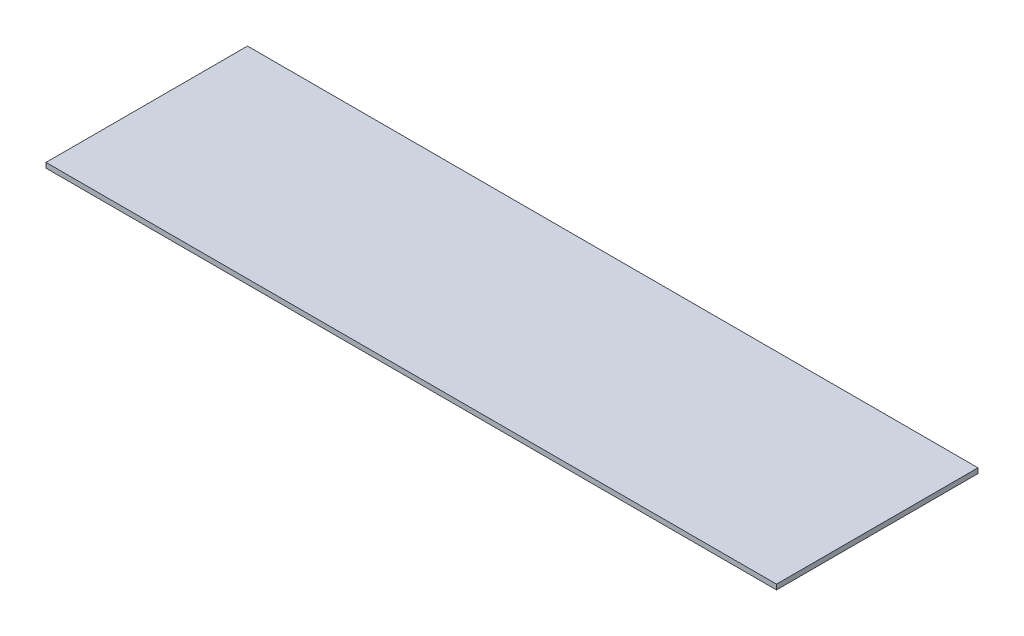
ISO-10303-21;
HEADER;
FILE_DESCRIPTION(('STEP AP214'),'2;1');
FILE_NAME('part.step','',(''),(''),'','','');
FILE_SCHEMA(('AUTOMOTIVE_DESIGN { 1 0 10303 214 1 1 1 1 }'));
ENDSEC;
DATA;
#1=APPLICATION_CONTEXT('core data for automotive mechanical design processes');
#2=APPLICATION_PROTOCOL_DEFINITION('international standard','automotive_design',2000,#1);
#3=PRODUCT_CONTEXT('',#1,'mechanical');
#4=PRODUCT('Part','Part','',(#3));
#5=PRODUCT_RELATED_PRODUCT_CATEGORY('part','',(#4));
#6=PRODUCT_DEFINITION_FORMATION('','',#4);
#7=PRODUCT_DEFINITION_CONTEXT('part definition',#1,'design');
#8=PRODUCT_DEFINITION('design','',#6,#7);
#9=PRODUCT_DEFINITION_SHAPE('','',#8);
#10=(LENGTH_UNIT() NAMED_UNIT(*) SI_UNIT(.MILLI.,.METRE.));
#11=(NAMED_UNIT(*) PLANE_ANGLE_UNIT() SI_UNIT($,.RADIAN.));
#12=(NAMED_UNIT(*) SI_UNIT($,.STERADIAN.) SOLID_ANGLE_UNIT());
#13=UNCERTAINTY_MEASURE_WITH_UNIT(LENGTH_MEASURE(1.E-05),#10,'distance_accuracy_value','');
#14=(GEOMETRIC_REPRESENTATION_CONTEXT(3) GLOBAL_UNCERTAINTY_ASSIGNED_CONTEXT((#13)) GLOBAL_UNIT_ASSIGNED_CONTEXT((#10,
#11,#12)) REPRESENTATION_CONTEXT('',''));
#15=CARTESIAN_POINT('',(0.,0.,0.));
#16=DIRECTION('',(0.,0.,1.));
#17=DIRECTION('',(1.,0.,0.));
#18=AXIS2_PLACEMENT_3D('',#15,#16,#17);
#19=CARTESIAN_POINT('',(145.,2.,40.));
#20=DIRECTION('',(-1.,0.,0.));
#21=DIRECTION('',(0.,0.,1.));
#22=AXIS2_PLACEMENT_3D('',#19,#20,#21);
#23=PLANE('',#22);
#24=DIRECTION('',(0.,0.,-1.));
#25=VECTOR('',#24,1.);
#26=CARTESIAN_POINT('',(145.,0.,40.));
#27=LINE('',#26,#25);
#28=CARTESIAN_POINT('',(145.,0.,40.));
#29=VERTEX_POINT('',#28);
#30=CARTESIAN_POINT('',(145.,0.,-40.));
#31=VERTEX_POINT('',#30);
#32=EDGE_CURVE('E96',#29,#31,#27,.T.);
#33=ORIENTED_EDGE('',*,*,#32,.T.);
#34=DIRECTION('',(0.,-1.,0.));
#35=VECTOR('',#34,1.);
#36=CARTESIAN_POINT('',(145.,2.,-40.));
#37=LINE('',#36,#35);
#38=CARTESIAN_POINT('',(145.,2.,-40.));
#39=VERTEX_POINT('',#38);
#40=EDGE_CURVE('E11',#39,#31,#37,.T.);
#41=ORIENTED_EDGE('',*,*,#40,.F.);
#42=DIRECTION('',(0.,0.,-1.));
#43=VECTOR('',#42,1.);
#44=CARTESIAN_POINT('',(145.,2.,40.));
#45=LINE('',#44,#43);
#46=CARTESIAN_POINT('',(145.,2.,40.));
#47=VERTEX_POINT('',#46);
#48=EDGE_CURVE('E84',#47,#39,#45,.T.);
#49=ORIENTED_EDGE('',*,*,#48,.F.);
#50=DIRECTION('',(0.,-1.,0.));
#51=VECTOR('',#50,1.);
#52=CARTESIAN_POINT('',(145.,2.,40.));
#53=LINE('',#52,#51);
#54=EDGE_CURVE('E92',#47,#29,#53,.T.);
#55=ORIENTED_EDGE('',*,*,#54,.T.);
#56=EDGE_LOOP('',(#33,#41,#49,#55));
#57=FACE_BOUND('',#56,.T.);
#58=ADVANCED_FACE('F33',(#57),#23,.F.);
#59=CARTESIAN_POINT('',(-145.,2.,-40.));
#60=DIRECTION('',(0.,0.,1.));
#61=DIRECTION('',(1.,0.,0.));
#62=AXIS2_PLACEMENT_3D('',#59,#60,#61);
#63=PLANE('',#62);
#64=DIRECTION('',(-1.,0.,0.));
#65=VECTOR('',#64,1.);
#66=CARTESIAN_POINT('',(-145.,0.,-40.));
#67=LINE('',#66,#65);
#68=CARTESIAN_POINT('',(-145.,0.,-40.));
#69=VERTEX_POINT('',#68);
#70=EDGE_CURVE('E88',#31,#69,#67,.T.);
#71=ORIENTED_EDGE('',*,*,#70,.T.);
#72=DIRECTION('',(0.,-1.,0.));
#73=VECTOR('',#72,1.);
#74=CARTESIAN_POINT('',(-145.,2.,-40.));
#75=LINE('',#74,#73);
#76=CARTESIAN_POINT('',(-145.,2.,-40.));
#77=VERTEX_POINT('',#76);
#78=EDGE_CURVE('E41',#77,#69,#75,.T.);
#79=ORIENTED_EDGE('',*,*,#78,.F.);
#80=DIRECTION('',(-1.,0.,0.));
#81=VECTOR('',#80,1.);
#82=CARTESIAN_POINT('',(-145.,2.,-40.));
#83=LINE('',#82,#81);
#84=EDGE_CURVE('E79',#39,#77,#83,.T.);
#85=ORIENTED_EDGE('',*,*,#84,.F.);
#86=ORIENTED_EDGE('',*,*,#40,.T.);
#87=EDGE_LOOP('',(#71,#79,#85,#86));
#88=FACE_BOUND('',#87,.T.);
#89=ADVANCED_FACE('F87',(#88),#63,.F.);
#90=CARTESIAN_POINT('',(-145.,2.,40.));
#91=DIRECTION('',(1.,0.,0.));
#92=DIRECTION('',(0.,0.,-1.));
#93=AXIS2_PLACEMENT_3D('',#90,#91,#92);
#94=PLANE('',#93);
#95=DIRECTION('',(0.,0.,1.));
#96=VECTOR('',#95,1.);
#97=CARTESIAN_POINT('',(-145.,0.,40.));
#98=LINE('',#97,#96);
#99=CARTESIAN_POINT('',(-145.,0.,40.));
#100=VERTEX_POINT('',#99);
#101=EDGE_CURVE('E66',#69,#100,#98,.T.);
#102=ORIENTED_EDGE('',*,*,#101,.T.);
#103=DIRECTION('',(0.,-1.,0.));
#104=VECTOR('',#103,1.);
#105=CARTESIAN_POINT('',(-145.,2.,40.));
#106=LINE('',#105,#104);
#107=CARTESIAN_POINT('',(-145.,2.,40.));
#108=VERTEX_POINT('',#107);
#109=EDGE_CURVE('E89',#108,#100,#106,.T.);
#110=ORIENTED_EDGE('',*,*,#109,.F.);
#111=DIRECTION('',(0.,0.,1.));
#112=VECTOR('',#111,1.);
#113=CARTESIAN_POINT('',(-145.,2.,40.));
#114=LINE('',#113,#112);
#115=EDGE_CURVE('E82',#77,#108,#114,.T.);
#116=ORIENTED_EDGE('',*,*,#115,.F.);
#117=ORIENTED_EDGE('',*,*,#78,.T.);
#118=EDGE_LOOP('',(#102,#110,#116,#117));
#119=FACE_BOUND('',#118,.T.);
#120=ADVANCED_FACE('F90',(#119),#94,.F.);
#121=CARTESIAN_POINT('',(-145.,2.,40.));
#122=DIRECTION('',(0.,0.,-1.));
#123=DIRECTION('',(-1.,0.,0.));
#124=AXIS2_PLACEMENT_3D('',#121,#122,#123);
#125=PLANE('',#124);
#126=DIRECTION('',(1.,0.,0.));
#127=VECTOR('',#126,1.);
#128=CARTESIAN_POINT('',(-145.,0.,40.));
#129=LINE('',#128,#127);
#130=EDGE_CURVE('E72',#100,#29,#129,.T.);
#131=ORIENTED_EDGE('',*,*,#130,.T.);
#132=ORIENTED_EDGE('',*,*,#54,.F.);
#133=DIRECTION('',(1.,0.,0.));
#134=VECTOR('',#133,1.);
#135=CARTESIAN_POINT('',(-145.,2.,40.));
#136=LINE('',#135,#134);
#137=EDGE_CURVE('E49',#108,#47,#136,.T.);
#138=ORIENTED_EDGE('',*,*,#137,.F.);
#139=ORIENTED_EDGE('',*,*,#109,.T.);
#140=EDGE_LOOP('',(#131,#132,#138,#139));
#141=FACE_BOUND('',#140,.T.);
#142=ADVANCED_FACE('F103',(#141),#125,.F.);
#143=CARTESIAN_POINT('',(0.,2.,0.));
#144=DIRECTION('',(0.,-1.,0.));
#145=DIRECTION('',(0.,0.,-1.));
#146=AXIS2_PLACEMENT_3D('',#143,#144,#145);
#147=PLANE('',#146);
#148=ORIENTED_EDGE('',*,*,#48,.T.);
#149=ORIENTED_EDGE('',*,*,#84,.T.);
#150=ORIENTED_EDGE('',*,*,#115,.T.);
#151=ORIENTED_EDGE('',*,*,#137,.T.);
#152=EDGE_LOOP('',(#148,#149,#150,#151));
#153=FACE_BOUND('',#152,.T.);
#154=ADVANCED_FACE('F80',(#153),#147,.F.);
#155=CARTESIAN_POINT('',(0.,0.,0.));
#156=DIRECTION('',(0.,-1.,0.));
#157=DIRECTION('',(0.,0.,-1.));
#158=AXIS2_PLACEMENT_3D('',#155,#156,#157);
#159=PLANE('',#158);
#160=ORIENTED_EDGE('',*,*,#32,.F.);
#161=ORIENTED_EDGE('',*,*,#130,.F.);
#162=ORIENTED_EDGE('',*,*,#101,.F.);
#163=ORIENTED_EDGE('',*,*,#70,.F.);
#164=EDGE_LOOP('',(#160,#161,#162,#163));
#165=FACE_BOUND('',#164,.T.);
#166=ADVANCED_FACE('F106',(#165),#159,.T.);
#167=CLOSED_SHELL('',(#58,#89,#120,#142,#154,#166));
#168=MANIFOLD_SOLID_BREP('B2',#167);
#169=ADVANCED_BREP_SHAPE_REPRESENTATION('',(#18,#168),#14);
#170=SHAPE_DEFINITION_REPRESENTATION(#9,#169);
ENDSEC;
END-ISO-10303-21;
